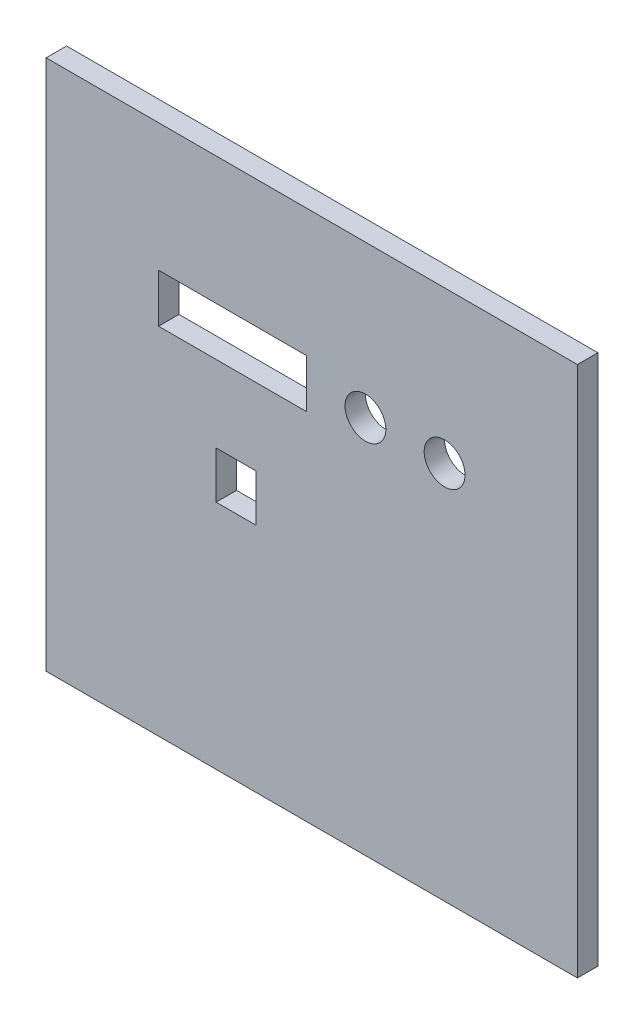
ISO-10303-21;
HEADER;
FILE_DESCRIPTION(('STEP AP214'),'2;1');
FILE_NAME('part.step','',(''),(''),'','','');
FILE_SCHEMA(('AUTOMOTIVE_DESIGN { 1 0 10303 214 1 1 1 1 }'));
ENDSEC;
DATA;
#1=APPLICATION_CONTEXT('core data for automotive mechanical design processes');
#2=APPLICATION_PROTOCOL_DEFINITION('international standard','automotive_design',2000,#1);
#3=PRODUCT_CONTEXT('',#1,'mechanical');
#4=PRODUCT('Part','Part','',(#3));
#5=PRODUCT_RELATED_PRODUCT_CATEGORY('part','',(#4));
#6=PRODUCT_DEFINITION_FORMATION('','',#4);
#7=PRODUCT_DEFINITION_CONTEXT('part definition',#1,'design');
#8=PRODUCT_DEFINITION('design','',#6,#7);
#9=PRODUCT_DEFINITION_SHAPE('','',#8);
#10=(LENGTH_UNIT() NAMED_UNIT(*) SI_UNIT(.MILLI.,.METRE.));
#11=(NAMED_UNIT(*) PLANE_ANGLE_UNIT() SI_UNIT($,.RADIAN.));
#12=(NAMED_UNIT(*) SI_UNIT($,.STERADIAN.) SOLID_ANGLE_UNIT());
#13=UNCERTAINTY_MEASURE_WITH_UNIT(LENGTH_MEASURE(1.E-05),#10,'distance_accuracy_value','');
#14=(GEOMETRIC_REPRESENTATION_CONTEXT(3) GLOBAL_UNCERTAINTY_ASSIGNED_CONTEXT((#13)) GLOBAL_UNIT_ASSIGNED_CONTEXT((#10,
#11,#12)) REPRESENTATION_CONTEXT('',''));
#15=CARTESIAN_POINT('',(0.,0.,0.));
#16=DIRECTION('',(0.,0.,1.));
#17=DIRECTION('',(1.,0.,0.));
#18=AXIS2_PLACEMENT_3D('',#15,#16,#17);
#19=CARTESIAN_POINT('',(-132.08,132.08,5.08));
#20=DIRECTION('',(1.,0.,0.));
#21=DIRECTION('',(0.,1.,0.));
#22=AXIS2_PLACEMENT_3D('',#19,#20,#21);
#23=PLANE('',#22);
#24=DIRECTION('',(0.,-1.,0.));
#25=VECTOR('',#24,1.);
#26=CARTESIAN_POINT('',(-132.08,132.08,-5.08));
#27=LINE('',#26,#25);
#28=CARTESIAN_POINT('',(-132.08,132.08,-5.08));
#29=VERTEX_POINT('',#28);
#30=CARTESIAN_POINT('',(-132.08,-132.08,-5.08));
#31=VERTEX_POINT('',#30);
#32=EDGE_CURVE('E217',#29,#31,#27,.T.);
#33=ORIENTED_EDGE('',*,*,#32,.T.);
#34=DIRECTION('',(0.,0.,-1.));
#35=VECTOR('',#34,1.);
#36=CARTESIAN_POINT('',(-132.08,-132.08,5.08));
#37=LINE('',#36,#35);
#38=CARTESIAN_POINT('',(-132.08,-132.08,5.08));
#39=VERTEX_POINT('',#38);
#40=EDGE_CURVE('E11',#39,#31,#37,.T.);
#41=ORIENTED_EDGE('',*,*,#40,.F.);
#42=DIRECTION('',(0.,-1.,0.));
#43=VECTOR('',#42,1.);
#44=CARTESIAN_POINT('',(-132.08,132.08,5.08));
#45=LINE('',#44,#43);
#46=CARTESIAN_POINT('',(-132.08,132.08,5.08));
#47=VERTEX_POINT('',#46);
#48=EDGE_CURVE('E226',#47,#39,#45,.T.);
#49=ORIENTED_EDGE('',*,*,#48,.F.);
#50=DIRECTION('',(0.,0.,-1.));
#51=VECTOR('',#50,1.);
#52=CARTESIAN_POINT('',(-132.08,132.08,5.08));
#53=LINE('',#52,#51);
#54=EDGE_CURVE('E242',#47,#29,#53,.T.);
#55=ORIENTED_EDGE('',*,*,#54,.T.);
#56=EDGE_LOOP('',(#33,#41,#49,#55));
#57=FACE_BOUND('',#56,.T.);
#58=ADVANCED_FACE('F39',(#57),#23,.F.);
#59=CARTESIAN_POINT('',(-132.08,-132.08,5.08));
#60=DIRECTION('',(0.,1.,0.));
#61=DIRECTION('',(0.,0.,1.));
#62=AXIS2_PLACEMENT_3D('',#59,#60,#61);
#63=PLANE('',#62);
#64=DIRECTION('',(1.,0.,0.));
#65=VECTOR('',#64,1.);
#66=CARTESIAN_POINT('',(-132.08,-132.08,-5.08));
#67=LINE('',#66,#65);
#68=CARTESIAN_POINT('',(132.08,-132.08,-5.08));
#69=VERTEX_POINT('',#68);
#70=EDGE_CURVE('E246',#31,#69,#67,.T.);
#71=ORIENTED_EDGE('',*,*,#70,.T.);
#72=DIRECTION('',(0.,0.,-1.));
#73=VECTOR('',#72,1.);
#74=CARTESIAN_POINT('',(132.08,-132.08,5.08));
#75=LINE('',#74,#73);
#76=CARTESIAN_POINT('',(132.08,-132.08,5.08));
#77=VERTEX_POINT('',#76);
#78=EDGE_CURVE('E47',#77,#69,#75,.T.);
#79=ORIENTED_EDGE('',*,*,#78,.F.);
#80=DIRECTION('',(1.,0.,0.));
#81=VECTOR('',#80,1.);
#82=CARTESIAN_POINT('',(-132.08,-132.08,5.08));
#83=LINE('',#82,#81);
#84=EDGE_CURVE('E230',#39,#77,#83,.T.);
#85=ORIENTED_EDGE('',*,*,#84,.F.);
#86=ORIENTED_EDGE('',*,*,#40,.T.);
#87=EDGE_LOOP('',(#71,#79,#85,#86));
#88=FACE_BOUND('',#87,.T.);
#89=ADVANCED_FACE('F268',(#88),#63,.F.);
#90=CARTESIAN_POINT('',(132.08,132.08,5.08));
#91=DIRECTION('',(1.,0.,0.));
#92=DIRECTION('',(0.,1.,0.));
#93=AXIS2_PLACEMENT_3D('',#90,#91,#92);
#94=PLANE('',#93);
#95=DIRECTION('',(0.,-1.,0.));
#96=VECTOR('',#95,1.);
#97=CARTESIAN_POINT('',(132.08,132.08,-5.08));
#98=LINE('',#97,#96);
#99=CARTESIAN_POINT('',(132.08,132.08,-5.08));
#100=VERTEX_POINT('',#99);
#101=EDGE_CURVE('E250',#100,#69,#98,.T.);
#102=ORIENTED_EDGE('',*,*,#101,.F.);
#103=DIRECTION('',(0.,0.,-1.));
#104=VECTOR('',#103,1.);
#105=CARTESIAN_POINT('',(132.08,132.08,5.08));
#106=LINE('',#105,#104);
#107=CARTESIAN_POINT('',(132.08,132.08,5.08));
#108=VERTEX_POINT('',#107);
#109=EDGE_CURVE('E259',#108,#100,#106,.T.);
#110=ORIENTED_EDGE('',*,*,#109,.F.);
#111=DIRECTION('',(0.,-1.,0.));
#112=VECTOR('',#111,1.);
#113=CARTESIAN_POINT('',(132.08,132.08,5.08));
#114=LINE('',#113,#112);
#115=EDGE_CURVE('E234',#108,#77,#114,.T.);
#116=ORIENTED_EDGE('',*,*,#115,.T.);
#117=ORIENTED_EDGE('',*,*,#78,.T.);
#118=EDGE_LOOP('',(#102,#110,#116,#117));
#119=FACE_BOUND('',#118,.T.);
#120=ADVANCED_FACE('F265',(#119),#94,.T.);
#121=CARTESIAN_POINT('',(-132.08,132.08,5.08));
#122=DIRECTION('',(0.,1.,0.));
#123=DIRECTION('',(0.,0.,1.));
#124=AXIS2_PLACEMENT_3D('',#121,#122,#123);
#125=PLANE('',#124);
#126=DIRECTION('',(1.,0.,0.));
#127=VECTOR('',#126,1.);
#128=CARTESIAN_POINT('',(-132.08,132.08,-5.08));
#129=LINE('',#128,#127);
#130=EDGE_CURVE('E231',#29,#100,#129,.T.);
#131=ORIENTED_EDGE('',*,*,#130,.F.);
#132=ORIENTED_EDGE('',*,*,#54,.F.);
#133=DIRECTION('',(1.,0.,0.));
#134=VECTOR('',#133,1.);
#135=CARTESIAN_POINT('',(-132.08,132.08,5.08));
#136=LINE('',#135,#134);
#137=EDGE_CURVE('E238',#47,#108,#136,.T.);
#138=ORIENTED_EDGE('',*,*,#137,.T.);
#139=ORIENTED_EDGE('',*,*,#109,.T.);
#140=EDGE_LOOP('',(#131,#132,#138,#139));
#141=FACE_BOUND('',#140,.T.);
#142=ADVANCED_FACE('F274',(#141),#125,.T.);
#143=CARTESIAN_POINT('',(0.,0.,5.08));
#144=DIRECTION('',(0.,0.,1.));
#145=DIRECTION('',(1.,0.,0.));
#146=AXIS2_PLACEMENT_3D('',#143,#144,#145);
#147=PLANE('',#146);
#148=DIRECTION('',(0.,1.,0.));
#149=VECTOR('',#148,1.);
#150=CARTESIAN_POINT('',(-27.7564762742842,6.34999999999993,5.08));
#151=LINE('',#150,#149);
#152=CARTESIAN_POINT('',(-27.7564762742842,-17.0180000000001,5.08));
#153=VERTEX_POINT('',#152);
#154=CARTESIAN_POINT('',(-27.7564762742842,6.34999999999993,5.08));
#155=VERTEX_POINT('',#154);
#156=EDGE_CURVE('E54',#153,#155,#151,.T.);
#157=ORIENTED_EDGE('',*,*,#156,.F.);
#158=DIRECTION('',(1.,0.,0.));
#159=VECTOR('',#158,1.);
#160=CARTESIAN_POINT('',(-47.5684762742842,-17.0180000000001,5.08));
#161=LINE('',#160,#159);
#162=CARTESIAN_POINT('',(-47.5684762742842,-17.0180000000001,5.08));
#163=VERTEX_POINT('',#162);
#164=EDGE_CURVE('E152',#163,#153,#161,.T.);
#165=ORIENTED_EDGE('',*,*,#164,.F.);
#166=DIRECTION('',(0.,-1.,0.));
#167=VECTOR('',#166,1.);
#168=CARTESIAN_POINT('',(-47.5684762742842,6.34999999999993,5.08));
#169=LINE('',#168,#167);
#170=CARTESIAN_POINT('',(-47.5684762742842,6.34999999999993,5.08));
#171=VERTEX_POINT('',#170);
#172=EDGE_CURVE('E156',#171,#163,#169,.T.);
#173=ORIENTED_EDGE('',*,*,#172,.F.);
#174=DIRECTION('',(-1.,0.,0.));
#175=VECTOR('',#174,1.);
#176=CARTESIAN_POINT('',(-47.5684762742842,6.34999999999993,5.08));
#177=LINE('',#176,#175);
#178=EDGE_CURVE('E168',#155,#171,#177,.T.);
#179=ORIENTED_EDGE('',*,*,#178,.F.);
#180=EDGE_LOOP('',(#157,#165,#173,#179));
#181=FACE_BOUND('',#180,.T.);
#182=CARTESIAN_POINT('',(66.04,56.5149999999999,5.08));
#183=DIRECTION('',(0.,0.,1.));
#184=DIRECTION('',(1.,0.,0.));
#185=AXIS2_PLACEMENT_3D('',#182,#183,#184);
#186=CIRCLE('',#185,10.16);
#187=CARTESIAN_POINT('',(76.2,56.5149999999999,5.08));
#188=VERTEX_POINT('',#187);
#189=EDGE_CURVE('E159',#188,#188,#186,.T.);
#190=ORIENTED_EDGE('',*,*,#189,.F.);
#191=EDGE_LOOP('',(#190));
#192=FACE_BOUND('',#191,.T.);
#193=CARTESIAN_POINT('',(26.67,56.5149999999999,5.08));
#194=DIRECTION('',(0.,0.,1.));
#195=DIRECTION('',(1.,0.,0.));
#196=AXIS2_PLACEMENT_3D('',#193,#194,#195);
#197=CIRCLE('',#196,10.16);
#198=CARTESIAN_POINT('',(36.83,56.5149999999999,5.08));
#199=VERTEX_POINT('',#198);
#200=EDGE_CURVE('E337',#199,#199,#197,.T.);
#201=ORIENTED_EDGE('',*,*,#200,.F.);
#202=EDGE_LOOP('',(#201));
#203=FACE_BOUND('',#202,.T.);
#204=DIRECTION('',(0.,1.,0.));
#205=VECTOR('',#204,1.);
#206=CARTESIAN_POINT('',(-2.53999999999997,68.5799999999999,5.08));
#207=LINE('',#206,#205);
#208=CARTESIAN_POINT('',(-2.53999999999997,44.4499999999999,5.08));
#209=VERTEX_POINT('',#208);
#210=CARTESIAN_POINT('',(-2.53999999999997,68.5799999999999,5.08));
#211=VERTEX_POINT('',#210);
#212=EDGE_CURVE('E62',#209,#211,#207,.T.);
#213=ORIENTED_EDGE('',*,*,#212,.F.);
#214=DIRECTION('',(1.,0.,0.));
#215=VECTOR('',#214,1.);
#216=CARTESIAN_POINT('',(-76.2,44.4499999999999,5.08));
#217=LINE('',#216,#215);
#218=CARTESIAN_POINT('',(-76.2,44.4499999999999,5.08));
#219=VERTEX_POINT('',#218);
#220=EDGE_CURVE('E187',#219,#209,#217,.T.);
#221=ORIENTED_EDGE('',*,*,#220,.F.);
#222=DIRECTION('',(0.,-1.,0.));
#223=VECTOR('',#222,1.);
#224=CARTESIAN_POINT('',(-76.2,68.5799999999999,5.08));
#225=LINE('',#224,#223);
#226=CARTESIAN_POINT('',(-76.2,68.5799999999999,5.08));
#227=VERTEX_POINT('',#226);
#228=EDGE_CURVE('E207',#227,#219,#225,.T.);
#229=ORIENTED_EDGE('',*,*,#228,.F.);
#230=DIRECTION('',(-1.,0.,0.));
#231=VECTOR('',#230,1.);
#232=CARTESIAN_POINT('',(-76.2,68.5799999999999,5.08));
#233=LINE('',#232,#231);
#234=EDGE_CURVE('E202',#211,#227,#233,.T.);
#235=ORIENTED_EDGE('',*,*,#234,.F.);
#236=EDGE_LOOP('',(#213,#221,#229,#235));
#237=FACE_BOUND('',#236,.T.);
#238=ORIENTED_EDGE('',*,*,#48,.T.);
#239=ORIENTED_EDGE('',*,*,#84,.T.);
#240=ORIENTED_EDGE('',*,*,#115,.F.);
#241=ORIENTED_EDGE('',*,*,#137,.F.);
#242=EDGE_LOOP('',(#238,#239,#240,#241));
#243=FACE_BOUND('',#242,.T.);
#244=ADVANCED_FACE('F278',(#181,#192,#203,#237,#243),#147,.T.);
#245=CARTESIAN_POINT('',(0.,0.,-5.08));
#246=DIRECTION('',(0.,0.,1.));
#247=DIRECTION('',(1.,0.,0.));
#248=AXIS2_PLACEMENT_3D('',#245,#246,#247);
#249=PLANE('',#248);
#250=DIRECTION('',(1.,0.,0.));
#251=VECTOR('',#250,1.);
#252=CARTESIAN_POINT('',(-47.5684762742842,-17.0180000000001,-5.08));
#253=LINE('',#252,#251);
#254=CARTESIAN_POINT('',(-47.5684762742842,-17.0180000000001,-5.08));
#255=VERTEX_POINT('',#254);
#256=CARTESIAN_POINT('',(-27.7564762742842,-17.0180000000001,-5.08));
#257=VERTEX_POINT('',#256);
#258=EDGE_CURVE('E137',#255,#257,#253,.T.);
#259=ORIENTED_EDGE('',*,*,#258,.T.);
#260=DIRECTION('',(0.,1.,0.));
#261=VECTOR('',#260,1.);
#262=CARTESIAN_POINT('',(-27.7564762742842,6.34999999999993,-5.08));
#263=LINE('',#262,#261);
#264=CARTESIAN_POINT('',(-27.7564762742842,6.34999999999993,-5.08));
#265=VERTEX_POINT('',#264);
#266=EDGE_CURVE('E130',#257,#265,#263,.T.);
#267=ORIENTED_EDGE('',*,*,#266,.T.);
#268=DIRECTION('',(-1.,0.,0.));
#269=VECTOR('',#268,1.);
#270=CARTESIAN_POINT('',(-47.5684762742842,6.34999999999993,-5.08));
#271=LINE('',#270,#269);
#272=CARTESIAN_POINT('',(-47.5684762742842,6.34999999999993,-5.08));
#273=VERTEX_POINT('',#272);
#274=EDGE_CURVE('E141',#265,#273,#271,.T.);
#275=ORIENTED_EDGE('',*,*,#274,.T.);
#276=DIRECTION('',(0.,-1.,0.));
#277=VECTOR('',#276,1.);
#278=CARTESIAN_POINT('',(-47.5684762742842,6.34999999999993,-5.08));
#279=LINE('',#278,#277);
#280=EDGE_CURVE('E146',#273,#255,#279,.T.);
#281=ORIENTED_EDGE('',*,*,#280,.T.);
#282=EDGE_LOOP('',(#259,#267,#275,#281));
#283=FACE_BOUND('',#282,.T.);
#284=CARTESIAN_POINT('',(66.04,56.5149999999999,-5.08));
#285=DIRECTION('',(0.,0.,1.));
#286=DIRECTION('',(1.,0.,0.));
#287=AXIS2_PLACEMENT_3D('',#284,#285,#286);
#288=CIRCLE('',#287,10.16);
#289=CARTESIAN_POINT('',(76.2,56.5149999999999,-5.08));
#290=VERTEX_POINT('',#289);
#291=EDGE_CURVE('E340',#290,#290,#288,.T.);
#292=ORIENTED_EDGE('',*,*,#291,.T.);
#293=EDGE_LOOP('',(#292));
#294=FACE_BOUND('',#293,.T.);
#295=CARTESIAN_POINT('',(26.67,56.5149999999999,-5.08));
#296=DIRECTION('',(0.,0.,1.));
#297=DIRECTION('',(1.,0.,0.));
#298=AXIS2_PLACEMENT_3D('',#295,#296,#297);
#299=CIRCLE('',#298,10.16);
#300=CARTESIAN_POINT('',(36.83,56.5149999999999,-5.08));
#301=VERTEX_POINT('',#300);
#302=EDGE_CURVE('E203',#301,#301,#299,.T.);
#303=ORIENTED_EDGE('',*,*,#302,.T.);
#304=EDGE_LOOP('',(#303));
#305=FACE_BOUND('',#304,.T.);
#306=DIRECTION('',(1.,0.,0.));
#307=VECTOR('',#306,1.);
#308=CARTESIAN_POINT('',(-76.2,44.4499999999999,-5.08));
#309=LINE('',#308,#307);
#310=CARTESIAN_POINT('',(-76.2,44.4499999999999,-5.08));
#311=VERTEX_POINT('',#310);
#312=CARTESIAN_POINT('',(-2.53999999999997,44.4499999999999,-5.08));
#313=VERTEX_POINT('',#312);
#314=EDGE_CURVE('E195',#311,#313,#309,.T.);
#315=ORIENTED_EDGE('',*,*,#314,.T.);
#316=DIRECTION('',(0.,1.,0.));
#317=VECTOR('',#316,1.);
#318=CARTESIAN_POINT('',(-2.53999999999997,68.5799999999999,-5.08));
#319=LINE('',#318,#317);
#320=CARTESIAN_POINT('',(-2.53999999999997,68.5799999999999,-5.08));
#321=VERTEX_POINT('',#320);
#322=EDGE_CURVE('E182',#313,#321,#319,.T.);
#323=ORIENTED_EDGE('',*,*,#322,.T.);
#324=DIRECTION('',(-1.,0.,0.));
#325=VECTOR('',#324,1.);
#326=CARTESIAN_POINT('',(-76.2,68.5799999999999,-5.08));
#327=LINE('',#326,#325);
#328=CARTESIAN_POINT('',(-76.2,68.5799999999999,-5.08));
#329=VERTEX_POINT('',#328);
#330=EDGE_CURVE('E186',#321,#329,#327,.T.);
#331=ORIENTED_EDGE('',*,*,#330,.T.);
#332=DIRECTION('',(0.,-1.,0.));
#333=VECTOR('',#332,1.);
#334=CARTESIAN_POINT('',(-76.2,68.5799999999999,-5.08));
#335=LINE('',#334,#333);
#336=EDGE_CURVE('E191',#329,#311,#335,.T.);
#337=ORIENTED_EDGE('',*,*,#336,.T.);
#338=EDGE_LOOP('',(#315,#323,#331,#337));
#339=FACE_BOUND('',#338,.T.);
#340=ORIENTED_EDGE('',*,*,#32,.F.);
#341=ORIENTED_EDGE('',*,*,#130,.T.);
#342=ORIENTED_EDGE('',*,*,#101,.T.);
#343=ORIENTED_EDGE('',*,*,#70,.F.);
#344=EDGE_LOOP('',(#340,#341,#342,#343));
#345=FACE_BOUND('',#344,.T.);
#346=ADVANCED_FACE('F148',(#283,#294,#305,#339,#345),#249,.F.);
#347=CARTESIAN_POINT('',(-2.53999999999997,68.5799999999999,-5.08));
#348=DIRECTION('',(1.,0.,0.));
#349=DIRECTION('',(0.,1.,0.));
#350=AXIS2_PLACEMENT_3D('',#347,#348,#349);
#351=PLANE('',#350);
#352=ORIENTED_EDGE('',*,*,#212,.T.);
#353=DIRECTION('',(0.,0.,1.));
#354=VECTOR('',#353,1.);
#355=CARTESIAN_POINT('',(-2.53999999999997,68.5799999999999,-5.08));
#356=LINE('',#355,#354);
#357=EDGE_CURVE('E199',#321,#211,#356,.T.);
#358=ORIENTED_EDGE('',*,*,#357,.F.);
#359=ORIENTED_EDGE('',*,*,#322,.F.);
#360=DIRECTION('',(0.,0.,1.));
#361=VECTOR('',#360,1.);
#362=CARTESIAN_POINT('',(-2.53999999999997,44.4499999999999,-5.08));
#363=LINE('',#362,#361);
#364=EDGE_CURVE('E214',#313,#209,#363,.T.);
#365=ORIENTED_EDGE('',*,*,#364,.T.);
#366=EDGE_LOOP('',(#352,#358,#359,#365));
#367=FACE_BOUND('',#366,.T.);
#368=ADVANCED_FACE('F293',(#367),#351,.F.);
#369=CARTESIAN_POINT('',(-76.2,44.4499999999999,-5.08));
#370=DIRECTION('',(0.,-1.,0.));
#371=DIRECTION('',(0.,0.,-1.));
#372=AXIS2_PLACEMENT_3D('',#369,#370,#371);
#373=PLANE('',#372);
#374=ORIENTED_EDGE('',*,*,#220,.T.);
#375=ORIENTED_EDGE('',*,*,#364,.F.);
#376=ORIENTED_EDGE('',*,*,#314,.F.);
#377=DIRECTION('',(0.,0.,1.));
#378=VECTOR('',#377,1.);
#379=CARTESIAN_POINT('',(-76.2,44.4499999999999,-5.08));
#380=LINE('',#379,#378);
#381=EDGE_CURVE('E218',#311,#219,#380,.T.);
#382=ORIENTED_EDGE('',*,*,#381,.T.);
#383=EDGE_LOOP('',(#374,#375,#376,#382));
#384=FACE_BOUND('',#383,.T.);
#385=ADVANCED_FACE('F299',(#384),#373,.F.);
#386=CARTESIAN_POINT('',(-76.2,68.5799999999999,-5.08));
#387=DIRECTION('',(-1.,0.,0.));
#388=DIRECTION('',(0.,0.,1.));
#389=AXIS2_PLACEMENT_3D('',#386,#387,#388);
#390=PLANE('',#389);
#391=ORIENTED_EDGE('',*,*,#228,.T.);
#392=ORIENTED_EDGE('',*,*,#381,.F.);
#393=ORIENTED_EDGE('',*,*,#336,.F.);
#394=DIRECTION('',(0.,0.,1.));
#395=VECTOR('',#394,1.);
#396=CARTESIAN_POINT('',(-76.2,68.5799999999999,-5.08));
#397=LINE('',#396,#395);
#398=EDGE_CURVE('E221',#329,#227,#397,.T.);
#399=ORIENTED_EDGE('',*,*,#398,.T.);
#400=EDGE_LOOP('',(#391,#392,#393,#399));
#401=FACE_BOUND('',#400,.T.);
#402=ADVANCED_FACE('F304',(#401),#390,.F.);
#403=CARTESIAN_POINT('',(-76.2,68.5799999999999,-5.08));
#404=DIRECTION('',(0.,1.,0.));
#405=DIRECTION('',(-1.,0.,0.));
#406=AXIS2_PLACEMENT_3D('',#403,#404,#405);
#407=PLANE('',#406);
#408=ORIENTED_EDGE('',*,*,#234,.T.);
#409=ORIENTED_EDGE('',*,*,#398,.F.);
#410=ORIENTED_EDGE('',*,*,#330,.F.);
#411=ORIENTED_EDGE('',*,*,#357,.T.);
#412=EDGE_LOOP('',(#408,#409,#410,#411));
#413=FACE_BOUND('',#412,.T.);
#414=ADVANCED_FACE('F300',(#413),#407,.F.);
#415=CARTESIAN_POINT('',(26.67,56.5149999999999,-5.08));
#416=DIRECTION('',(0.,0.,1.));
#417=DIRECTION('',(1.,0.,0.));
#418=AXIS2_PLACEMENT_3D('',#415,#416,#417);
#419=CYLINDRICAL_SURFACE('',#418,10.16);
#420=ORIENTED_EDGE('',*,*,#302,.F.);
#421=EDGE_LOOP('',(#420));
#422=FACE_BOUND('',#421,.T.);
#423=ORIENTED_EDGE('',*,*,#200,.T.);
#424=EDGE_LOOP('',(#423));
#425=FACE_BOUND('',#424,.T.);
#426=ADVANCED_FACE('F303',(#422,#425),#419,.F.);
#427=CARTESIAN_POINT('',(66.04,56.5149999999999,-5.08));
#428=DIRECTION('',(0.,0.,1.));
#429=DIRECTION('',(1.,0.,0.));
#430=AXIS2_PLACEMENT_3D('',#427,#428,#429);
#431=CYLINDRICAL_SURFACE('',#430,10.16);
#432=ORIENTED_EDGE('',*,*,#291,.F.);
#433=EDGE_LOOP('',(#432));
#434=FACE_BOUND('',#433,.T.);
#435=ORIENTED_EDGE('',*,*,#189,.T.);
#436=EDGE_LOOP('',(#435));
#437=FACE_BOUND('',#436,.T.);
#438=ADVANCED_FACE('F315',(#434,#437),#431,.F.);
#439=CARTESIAN_POINT('',(-27.7564762742842,6.34999999999993,-5.08));
#440=DIRECTION('',(1.,0.,0.));
#441=DIRECTION('',(0.,1.,0.));
#442=AXIS2_PLACEMENT_3D('',#439,#440,#441);
#443=PLANE('',#442);
#444=ORIENTED_EDGE('',*,*,#156,.T.);
#445=DIRECTION('',(0.,0.,1.));
#446=VECTOR('',#445,1.);
#447=CARTESIAN_POINT('',(-27.7564762742842,6.34999999999993,-5.08));
#448=LINE('',#447,#446);
#449=EDGE_CURVE('E126',#265,#155,#448,.T.);
#450=ORIENTED_EDGE('',*,*,#449,.F.);
#451=ORIENTED_EDGE('',*,*,#266,.F.);
#452=DIRECTION('',(0.,0.,1.));
#453=VECTOR('',#452,1.);
#454=CARTESIAN_POINT('',(-27.7564762742842,-17.0180000000001,-5.08));
#455=LINE('',#454,#453);
#456=EDGE_CURVE('E174',#257,#153,#455,.T.);
#457=ORIENTED_EDGE('',*,*,#456,.T.);
#458=EDGE_LOOP('',(#444,#450,#451,#457));
#459=FACE_BOUND('',#458,.T.);
#460=ADVANCED_FACE('F128',(#459),#443,.F.);
#461=CARTESIAN_POINT('',(-47.5684762742842,-17.0180000000001,-5.08));
#462=DIRECTION('',(0.,-1.,0.));
#463=DIRECTION('',(0.,0.,-1.));
#464=AXIS2_PLACEMENT_3D('',#461,#462,#463);
#465=PLANE('',#464);
#466=ORIENTED_EDGE('',*,*,#164,.T.);
#467=ORIENTED_EDGE('',*,*,#456,.F.);
#468=ORIENTED_EDGE('',*,*,#258,.F.);
#469=DIRECTION('',(0.,0.,1.));
#470=VECTOR('',#469,1.);
#471=CARTESIAN_POINT('',(-47.5684762742842,-17.0180000000001,-5.08));
#472=LINE('',#471,#470);
#473=EDGE_CURVE('E177',#255,#163,#472,.T.);
#474=ORIENTED_EDGE('',*,*,#473,.T.);
#475=EDGE_LOOP('',(#466,#467,#468,#474));
#476=FACE_BOUND('',#475,.T.);
#477=ADVANCED_FACE('F314',(#476),#465,.F.);
#478=CARTESIAN_POINT('',(-47.5684762742842,6.34999999999993,-5.08));
#479=DIRECTION('',(-1.,0.,0.));
#480=DIRECTION('',(0.,0.,1.));
#481=AXIS2_PLACEMENT_3D('',#478,#479,#480);
#482=PLANE('',#481);
#483=ORIENTED_EDGE('',*,*,#172,.T.);
#484=ORIENTED_EDGE('',*,*,#473,.F.);
#485=ORIENTED_EDGE('',*,*,#280,.F.);
#486=DIRECTION('',(0.,0.,1.));
#487=VECTOR('',#486,1.);
#488=CARTESIAN_POINT('',(-47.5684762742842,6.34999999999993,-5.08));
#489=LINE('',#488,#487);
#490=EDGE_CURVE('E136',#273,#171,#489,.T.);
#491=ORIENTED_EDGE('',*,*,#490,.T.);
#492=EDGE_LOOP('',(#483,#484,#485,#491));
#493=FACE_BOUND('',#492,.T.);
#494=ADVANCED_FACE('F318',(#493),#482,.F.);
#495=CARTESIAN_POINT('',(-47.5684762742842,6.34999999999993,-5.08));
#496=DIRECTION('',(0.,1.,0.));
#497=DIRECTION('',(0.,0.,1.));
#498=AXIS2_PLACEMENT_3D('',#495,#496,#497);
#499=PLANE('',#498);
#500=ORIENTED_EDGE('',*,*,#178,.T.);
#501=ORIENTED_EDGE('',*,*,#490,.F.);
#502=ORIENTED_EDGE('',*,*,#274,.F.);
#503=ORIENTED_EDGE('',*,*,#449,.T.);
#504=EDGE_LOOP('',(#500,#501,#502,#503));
#505=FACE_BOUND('',#504,.T.);
#506=ADVANCED_FACE('F142',(#505),#499,.F.);
#507=CLOSED_SHELL('',(#58,#89,#120,#142,#244,#346,#368,#385,#402,#414,#426,#438,#460,#477,#494,#506));
#508=MANIFOLD_SOLID_BREP('B2',#507);
#509=ADVANCED_BREP_SHAPE_REPRESENTATION('',(#18,#508),#14);
#510=SHAPE_DEFINITION_REPRESENTATION(#9,#509);
ENDSEC;
END-ISO-10303-21;
